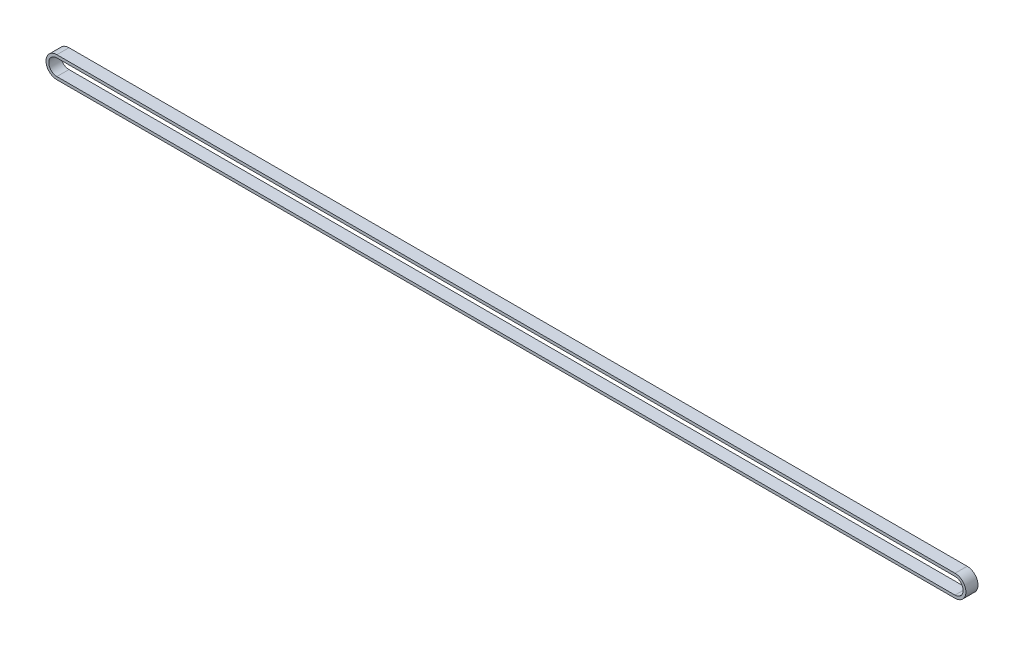
ISO-10303-21;
HEADER;
FILE_DESCRIPTION(('STEP AP214'),'2;1');
FILE_NAME('part.step','',(''),(''),'','','');
FILE_SCHEMA(('AUTOMOTIVE_DESIGN { 1 0 10303 214 1 1 1 1 }'));
ENDSEC;
DATA;
#1=APPLICATION_CONTEXT('core data for automotive mechanical design processes');
#2=APPLICATION_PROTOCOL_DEFINITION('international standard','automotive_design',2000,#1);
#3=PRODUCT_CONTEXT('',#1,'mechanical');
#4=PRODUCT('Part','Part','',(#3));
#5=PRODUCT_RELATED_PRODUCT_CATEGORY('part','',(#4));
#6=PRODUCT_DEFINITION_FORMATION('','',#4);
#7=PRODUCT_DEFINITION_CONTEXT('part definition',#1,'design');
#8=PRODUCT_DEFINITION('design','',#6,#7);
#9=PRODUCT_DEFINITION_SHAPE('','',#8);
#10=(LENGTH_UNIT() NAMED_UNIT(*) SI_UNIT(.MILLI.,.METRE.));
#11=(NAMED_UNIT(*) PLANE_ANGLE_UNIT() SI_UNIT($,.RADIAN.));
#12=(NAMED_UNIT(*) SI_UNIT($,.STERADIAN.) SOLID_ANGLE_UNIT());
#13=UNCERTAINTY_MEASURE_WITH_UNIT(LENGTH_MEASURE(1.E-05),#10,'distance_accuracy_value','');
#14=(GEOMETRIC_REPRESENTATION_CONTEXT(3) GLOBAL_UNCERTAINTY_ASSIGNED_CONTEXT((#13)) GLOBAL_UNIT_ASSIGNED_CONTEXT((#10,
#11,#12)) REPRESENTATION_CONTEXT('',''));
#15=CARTESIAN_POINT('',(0.,0.,0.));
#16=DIRECTION('',(0.,0.,1.));
#17=DIRECTION('',(1.,0.,0.));
#18=AXIS2_PLACEMENT_3D('',#15,#16,#17);
#19=CARTESIAN_POINT('',(-222.5,0.,6.));
#20=DIRECTION('',(0.,0.,1.));
#21=DIRECTION('',(1.,0.,0.));
#22=AXIS2_PLACEMENT_3D('',#19,#20,#21);
#23=PLANE('',#22);
#24=CARTESIAN_POINT('',(-222.5,0.,6.));
#25=DIRECTION('',(0.,0.,1.));
#26=DIRECTION('',(1.,0.,0.));
#27=AXIS2_PLACEMENT_3D('',#24,#25,#26);
#28=CIRCLE('',#27,5.38);
#29=CARTESIAN_POINT('',(-222.5,5.38,6.));
#30=VERTEX_POINT('',#29);
#31=CARTESIAN_POINT('',(-222.5,-5.38,6.));
#32=VERTEX_POINT('',#31);
#33=EDGE_CURVE('E133',#30,#32,#28,.T.);
#34=ORIENTED_EDGE('',*,*,#33,.T.);
#35=DIRECTION('',(1.,0.,0.));
#36=VECTOR('',#35,1.);
#37=CARTESIAN_POINT('',(-222.5,-5.38,6.));
#38=LINE('',#37,#36);
#39=CARTESIAN_POINT('',(222.5,-5.38,6.));
#40=VERTEX_POINT('',#39);
#41=EDGE_CURVE('E136',#32,#40,#38,.T.);
#42=ORIENTED_EDGE('',*,*,#41,.T.);
#43=CARTESIAN_POINT('',(222.5,0.,6.));
#44=DIRECTION('',(0.,0.,1.));
#45=DIRECTION('',(1.,0.,0.));
#46=AXIS2_PLACEMENT_3D('',#43,#44,#45);
#47=CIRCLE('',#46,5.38);
#48=CARTESIAN_POINT('',(222.5,5.38,6.));
#49=VERTEX_POINT('',#48);
#50=EDGE_CURVE('E139',#40,#49,#47,.T.);
#51=ORIENTED_EDGE('',*,*,#50,.T.);
#52=DIRECTION('',(-1.,0.,0.));
#53=VECTOR('',#52,1.);
#54=CARTESIAN_POINT('',(-222.5,5.38,6.));
#55=LINE('',#54,#53);
#56=EDGE_CURVE('E141',#49,#30,#55,.T.);
#57=ORIENTED_EDGE('',*,*,#56,.T.);
#58=EDGE_LOOP('',(#34,#42,#51,#57));
#59=FACE_BOUND('',#58,.T.);
#60=DIRECTION('',(-1.,0.,0.));
#61=VECTOR('',#60,1.);
#62=CARTESIAN_POINT('',(-222.5,4.,6.));
#63=LINE('',#62,#61);
#64=CARTESIAN_POINT('',(222.5,4.,6.));
#65=VERTEX_POINT('',#64);
#66=CARTESIAN_POINT('',(-222.5,4.,6.));
#67=VERTEX_POINT('',#66);
#68=EDGE_CURVE('E105',#65,#67,#63,.T.);
#69=ORIENTED_EDGE('',*,*,#68,.F.);
#70=CARTESIAN_POINT('',(222.5,0.,6.));
#71=DIRECTION('',(0.,0.,1.));
#72=DIRECTION('',(1.,0.,0.));
#73=AXIS2_PLACEMENT_3D('',#70,#71,#72);
#74=CIRCLE('',#73,4.);
#75=CARTESIAN_POINT('',(222.5,-4.,6.));
#76=VERTEX_POINT('',#75);
#77=EDGE_CURVE('E97',#76,#65,#74,.T.);
#78=ORIENTED_EDGE('',*,*,#77,.F.);
#79=DIRECTION('',(1.,0.,0.));
#80=VECTOR('',#79,1.);
#81=CARTESIAN_POINT('',(-222.5,-4.,6.));
#82=LINE('',#81,#80);
#83=CARTESIAN_POINT('',(-222.5,-4.,6.));
#84=VERTEX_POINT('',#83);
#85=EDGE_CURVE('E119',#84,#76,#82,.T.);
#86=ORIENTED_EDGE('',*,*,#85,.F.);
#87=CARTESIAN_POINT('',(-222.5,0.,6.));
#88=DIRECTION('',(0.,0.,1.));
#89=DIRECTION('',(1.,0.,0.));
#90=AXIS2_PLACEMENT_3D('',#87,#88,#89);
#91=CIRCLE('',#90,4.);
#92=EDGE_CURVE('E117',#67,#84,#91,.T.);
#93=ORIENTED_EDGE('',*,*,#92,.F.);
#94=EDGE_LOOP('',(#69,#78,#86,#93));
#95=FACE_BOUND('',#94,.T.);
#96=ADVANCED_FACE('F32',(#59,#95),#23,.T.);
#97=CARTESIAN_POINT('',(-222.5,0.,0.));
#98=DIRECTION('',(0.,0.,1.));
#99=DIRECTION('',(1.,0.,0.));
#100=AXIS2_PLACEMENT_3D('',#97,#98,#99);
#101=PLANE('',#100);
#102=CARTESIAN_POINT('',(-222.5,0.,0.));
#103=DIRECTION('',(0.,0.,1.));
#104=DIRECTION('',(1.,0.,0.));
#105=AXIS2_PLACEMENT_3D('',#102,#103,#104);
#106=CIRCLE('',#105,5.38);
#107=CARTESIAN_POINT('',(-222.5,5.38,0.));
#108=VERTEX_POINT('',#107);
#109=CARTESIAN_POINT('',(-222.5,-5.38,0.));
#110=VERTEX_POINT('',#109);
#111=EDGE_CURVE('E113',#108,#110,#106,.T.);
#112=ORIENTED_EDGE('',*,*,#111,.F.);
#113=DIRECTION('',(-1.,0.,0.));
#114=VECTOR('',#113,1.);
#115=CARTESIAN_POINT('',(-222.5,5.38,0.));
#116=LINE('',#115,#114);
#117=CARTESIAN_POINT('',(222.5,5.38,0.));
#118=VERTEX_POINT('',#117);
#119=EDGE_CURVE('E137',#118,#108,#116,.T.);
#120=ORIENTED_EDGE('',*,*,#119,.F.);
#121=CARTESIAN_POINT('',(222.5,0.,0.));
#122=DIRECTION('',(0.,0.,1.));
#123=DIRECTION('',(1.,0.,0.));
#124=AXIS2_PLACEMENT_3D('',#121,#122,#123);
#125=CIRCLE('',#124,5.38);
#126=CARTESIAN_POINT('',(222.5,-5.38,0.));
#127=VERTEX_POINT('',#126);
#128=EDGE_CURVE('E148',#127,#118,#125,.T.);
#129=ORIENTED_EDGE('',*,*,#128,.F.);
#130=DIRECTION('',(1.,0.,0.));
#131=VECTOR('',#130,1.);
#132=CARTESIAN_POINT('',(-222.5,-5.38,0.));
#133=LINE('',#132,#131);
#134=EDGE_CURVE('E146',#110,#127,#133,.T.);
#135=ORIENTED_EDGE('',*,*,#134,.F.);
#136=EDGE_LOOP('',(#112,#120,#129,#135));
#137=FACE_BOUND('',#136,.T.);
#138=CARTESIAN_POINT('',(222.5,0.,0.));
#139=DIRECTION('',(0.,0.,1.));
#140=DIRECTION('',(1.,0.,0.));
#141=AXIS2_PLACEMENT_3D('',#138,#139,#140);
#142=CIRCLE('',#141,4.);
#143=CARTESIAN_POINT('',(222.5,-4.,0.));
#144=VERTEX_POINT('',#143);
#145=CARTESIAN_POINT('',(222.5,4.,0.));
#146=VERTEX_POINT('',#145);
#147=EDGE_CURVE('E55',#144,#146,#142,.T.);
#148=ORIENTED_EDGE('',*,*,#147,.T.);
#149=DIRECTION('',(-1.,0.,0.));
#150=VECTOR('',#149,1.);
#151=CARTESIAN_POINT('',(-222.5,4.,0.));
#152=LINE('',#151,#150);
#153=CARTESIAN_POINT('',(-222.5,4.,0.));
#154=VERTEX_POINT('',#153);
#155=EDGE_CURVE('E112',#146,#154,#152,.T.);
#156=ORIENTED_EDGE('',*,*,#155,.T.);
#157=CARTESIAN_POINT('',(-222.5,0.,0.));
#158=DIRECTION('',(0.,0.,1.));
#159=DIRECTION('',(1.,0.,0.));
#160=AXIS2_PLACEMENT_3D('',#157,#158,#159);
#161=CIRCLE('',#160,4.);
#162=CARTESIAN_POINT('',(-222.5,-4.,0.));
#163=VERTEX_POINT('',#162);
#164=EDGE_CURVE('E125',#154,#163,#161,.T.);
#165=ORIENTED_EDGE('',*,*,#164,.T.);
#166=DIRECTION('',(1.,0.,0.));
#167=VECTOR('',#166,1.);
#168=CARTESIAN_POINT('',(-222.5,-4.,0.));
#169=LINE('',#168,#167);
#170=EDGE_CURVE('E106',#163,#144,#169,.T.);
#171=ORIENTED_EDGE('',*,*,#170,.T.);
#172=EDGE_LOOP('',(#148,#156,#165,#171));
#173=FACE_BOUND('',#172,.T.);
#174=ADVANCED_FACE('F166',(#137,#173),#101,.F.);
#175=CARTESIAN_POINT('',(-222.5,0.,6.));
#176=DIRECTION('',(0.,0.,-1.));
#177=DIRECTION('',(-1.,0.,0.));
#178=AXIS2_PLACEMENT_3D('',#175,#176,#177);
#179=CYLINDRICAL_SURFACE('',#178,5.38);
#180=ORIENTED_EDGE('',*,*,#111,.T.);
#181=DIRECTION('',(0.,0.,-1.));
#182=VECTOR('',#181,1.);
#183=CARTESIAN_POINT('',(-222.5,-5.38,6.));
#184=LINE('',#183,#182);
#185=EDGE_CURVE('E11',#32,#110,#184,.T.);
#186=ORIENTED_EDGE('',*,*,#185,.F.);
#187=ORIENTED_EDGE('',*,*,#33,.F.);
#188=DIRECTION('',(0.,0.,-1.));
#189=VECTOR('',#188,1.);
#190=CARTESIAN_POINT('',(-222.5,5.38,6.));
#191=LINE('',#190,#189);
#192=EDGE_CURVE('E143',#30,#108,#191,.T.);
#193=ORIENTED_EDGE('',*,*,#192,.T.);
#194=EDGE_LOOP('',(#180,#186,#187,#193));
#195=FACE_BOUND('',#194,.T.);
#196=ADVANCED_FACE('F34',(#195),#179,.T.);
#197=CARTESIAN_POINT('',(-222.5,-5.38,6.));
#198=DIRECTION('',(0.,1.,0.));
#199=DIRECTION('',(0.,0.,1.));
#200=AXIS2_PLACEMENT_3D('',#197,#198,#199);
#201=PLANE('',#200);
#202=ORIENTED_EDGE('',*,*,#134,.T.);
#203=DIRECTION('',(0.,0.,-1.));
#204=VECTOR('',#203,1.);
#205=CARTESIAN_POINT('',(222.5,-5.38,6.));
#206=LINE('',#205,#204);
#207=EDGE_CURVE('E40',#40,#127,#206,.T.);
#208=ORIENTED_EDGE('',*,*,#207,.F.);
#209=ORIENTED_EDGE('',*,*,#41,.F.);
#210=ORIENTED_EDGE('',*,*,#185,.T.);
#211=EDGE_LOOP('',(#202,#208,#209,#210));
#212=FACE_BOUND('',#211,.T.);
#213=ADVANCED_FACE('F176',(#212),#201,.F.);
#214=CARTESIAN_POINT('',(222.5,0.,6.));
#215=DIRECTION('',(0.,0.,-1.));
#216=DIRECTION('',(-1.,0.,0.));
#217=AXIS2_PLACEMENT_3D('',#214,#215,#216);
#218=CYLINDRICAL_SURFACE('',#217,5.38);
#219=ORIENTED_EDGE('',*,*,#128,.T.);
#220=DIRECTION('',(0.,0.,-1.));
#221=VECTOR('',#220,1.);
#222=CARTESIAN_POINT('',(222.5,5.38,6.));
#223=LINE('',#222,#221);
#224=EDGE_CURVE('E153',#49,#118,#223,.T.);
#225=ORIENTED_EDGE('',*,*,#224,.F.);
#226=ORIENTED_EDGE('',*,*,#50,.F.);
#227=ORIENTED_EDGE('',*,*,#207,.T.);
#228=EDGE_LOOP('',(#219,#225,#226,#227));
#229=FACE_BOUND('',#228,.T.);
#230=ADVANCED_FACE('F160',(#229),#218,.T.);
#231=CARTESIAN_POINT('',(-222.5,5.38,6.));
#232=DIRECTION('',(0.,-1.,0.));
#233=DIRECTION('',(0.,0.,-1.));
#234=AXIS2_PLACEMENT_3D('',#231,#232,#233);
#235=PLANE('',#234);
#236=ORIENTED_EDGE('',*,*,#119,.T.);
#237=ORIENTED_EDGE('',*,*,#192,.F.);
#238=ORIENTED_EDGE('',*,*,#56,.F.);
#239=ORIENTED_EDGE('',*,*,#224,.T.);
#240=EDGE_LOOP('',(#236,#237,#238,#239));
#241=FACE_BOUND('',#240,.T.);
#242=ADVANCED_FACE('F170',(#241),#235,.F.);
#243=CARTESIAN_POINT('',(222.5,0.,6.));
#244=DIRECTION('',(0.,0.,-1.));
#245=DIRECTION('',(-1.,0.,0.));
#246=AXIS2_PLACEMENT_3D('',#243,#244,#245);
#247=CYLINDRICAL_SURFACE('',#246,4.);
#248=ORIENTED_EDGE('',*,*,#147,.F.);
#249=DIRECTION('',(0.,0.,-1.));
#250=VECTOR('',#249,1.);
#251=CARTESIAN_POINT('',(222.5,-4.,6.));
#252=LINE('',#251,#250);
#253=EDGE_CURVE('E101',#76,#144,#252,.T.);
#254=ORIENTED_EDGE('',*,*,#253,.F.);
#255=ORIENTED_EDGE('',*,*,#77,.T.);
#256=DIRECTION('',(0.,0.,-1.));
#257=VECTOR('',#256,1.);
#258=CARTESIAN_POINT('',(222.5,4.,6.));
#259=LINE('',#258,#257);
#260=EDGE_CURVE('E100',#65,#146,#259,.T.);
#261=ORIENTED_EDGE('',*,*,#260,.T.);
#262=EDGE_LOOP('',(#248,#254,#255,#261));
#263=FACE_BOUND('',#262,.T.);
#264=ADVANCED_FACE('F99',(#263),#247,.F.);
#265=CARTESIAN_POINT('',(-222.5,4.,6.));
#266=DIRECTION('',(0.,-1.,0.));
#267=DIRECTION('',(0.,0.,-1.));
#268=AXIS2_PLACEMENT_3D('',#265,#266,#267);
#269=PLANE('',#268);
#270=ORIENTED_EDGE('',*,*,#155,.F.);
#271=ORIENTED_EDGE('',*,*,#260,.F.);
#272=ORIENTED_EDGE('',*,*,#68,.T.);
#273=DIRECTION('',(0.,0.,-1.));
#274=VECTOR('',#273,1.);
#275=CARTESIAN_POINT('',(-222.5,4.,6.));
#276=LINE('',#275,#274);
#277=EDGE_CURVE('E114',#67,#154,#276,.T.);
#278=ORIENTED_EDGE('',*,*,#277,.T.);
#279=EDGE_LOOP('',(#270,#271,#272,#278));
#280=FACE_BOUND('',#279,.T.);
#281=ADVANCED_FACE('F109',(#280),#269,.T.);
#282=CARTESIAN_POINT('',(-222.5,0.,6.));
#283=DIRECTION('',(0.,0.,-1.));
#284=DIRECTION('',(-1.,0.,0.));
#285=AXIS2_PLACEMENT_3D('',#282,#283,#284);
#286=CYLINDRICAL_SURFACE('',#285,4.);
#287=ORIENTED_EDGE('',*,*,#164,.F.);
#288=ORIENTED_EDGE('',*,*,#277,.F.);
#289=ORIENTED_EDGE('',*,*,#92,.T.);
#290=DIRECTION('',(0.,0.,-1.));
#291=VECTOR('',#290,1.);
#292=CARTESIAN_POINT('',(-222.5,-4.,6.));
#293=LINE('',#292,#291);
#294=EDGE_CURVE('E47',#84,#163,#293,.T.);
#295=ORIENTED_EDGE('',*,*,#294,.T.);
#296=EDGE_LOOP('',(#287,#288,#289,#295));
#297=FACE_BOUND('',#296,.T.);
#298=ADVANCED_FACE('F199',(#297),#286,.F.);
#299=CARTESIAN_POINT('',(-222.5,-4.,6.));
#300=DIRECTION('',(0.,1.,0.));
#301=DIRECTION('',(0.,0.,1.));
#302=AXIS2_PLACEMENT_3D('',#299,#300,#301);
#303=PLANE('',#302);
#304=ORIENTED_EDGE('',*,*,#170,.F.);
#305=ORIENTED_EDGE('',*,*,#294,.F.);
#306=ORIENTED_EDGE('',*,*,#85,.T.);
#307=ORIENTED_EDGE('',*,*,#253,.T.);
#308=EDGE_LOOP('',(#304,#305,#306,#307));
#309=FACE_BOUND('',#308,.T.);
#310=ADVANCED_FACE('F203',(#309),#303,.T.);
#311=CLOSED_SHELL('',(#96,#174,#196,#213,#230,#242,#264,#281,#298,#310));
#312=MANIFOLD_SOLID_BREP('B2',#311);
#313=ADVANCED_BREP_SHAPE_REPRESENTATION('',(#18,#312),#14);
#314=SHAPE_DEFINITION_REPRESENTATION(#9,#313);
ENDSEC;
END-ISO-10303-21;
